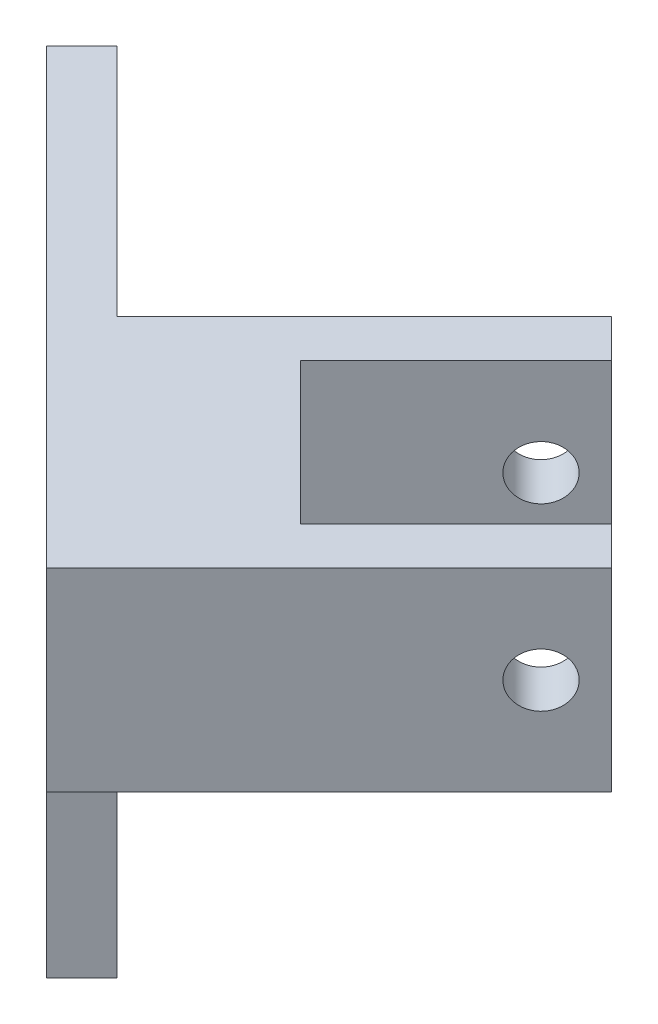
ISO-10303-21;
HEADER;
FILE_DESCRIPTION(('STEP AP214'),'2;1');
FILE_NAME('part.step','',(''),(''),'','','');
FILE_SCHEMA(('AUTOMOTIVE_DESIGN { 1 0 10303 214 1 1 1 1 }'));
ENDSEC;
DATA;
#1=APPLICATION_CONTEXT('core data for automotive mechanical design processes');
#2=APPLICATION_PROTOCOL_DEFINITION('international standard','automotive_design',2000,#1);
#3=PRODUCT_CONTEXT('',#1,'mechanical');
#4=PRODUCT('Part','Part','',(#3));
#5=PRODUCT_RELATED_PRODUCT_CATEGORY('part','',(#4));
#6=PRODUCT_DEFINITION_FORMATION('','',#4);
#7=PRODUCT_DEFINITION_CONTEXT('part definition',#1,'design');
#8=PRODUCT_DEFINITION('design','',#6,#7);
#9=PRODUCT_DEFINITION_SHAPE('','',#8);
#10=(LENGTH_UNIT() NAMED_UNIT(*) SI_UNIT(.MILLI.,.METRE.));
#11=(NAMED_UNIT(*) PLANE_ANGLE_UNIT() SI_UNIT($,.RADIAN.));
#12=(NAMED_UNIT(*) SI_UNIT($,.STERADIAN.) SOLID_ANGLE_UNIT());
#13=UNCERTAINTY_MEASURE_WITH_UNIT(LENGTH_MEASURE(1.E-05),#10,'distance_accuracy_value','');
#14=(GEOMETRIC_REPRESENTATION_CONTEXT(3) GLOBAL_UNCERTAINTY_ASSIGNED_CONTEXT((#13)) GLOBAL_UNIT_ASSIGNED_CONTEXT((#10,
#11,#12)) REPRESENTATION_CONTEXT('',''));
#15=CARTESIAN_POINT('',(0.,0.,0.));
#16=DIRECTION('',(0.,0.,1.));
#17=DIRECTION('',(1.,0.,0.));
#18=AXIS2_PLACEMENT_3D('',#15,#16,#17);
#19=CARTESIAN_POINT('',(33.1841385306785,32.8244024825225,-33.1841385306784));
#20=DIRECTION('',(0.,1.,0.));
#21=DIRECTION('',(0.,0.,1.));
#22=AXIS2_PLACEMENT_3D('',#19,#20,#21);
#23=PLANE('',#22);
#24=DIRECTION('',(0.707106781186547,0.,-0.707106781186548));
#25=VECTOR('',#24,1.);
#26=CARTESIAN_POINT('',(41.8762467926332,32.8244024825225,-24.4920302687237));
#27=LINE('',#26,#25);
#28=CARTESIAN_POINT('',(54.6041688539911,32.8244024825225,-37.2199523300816));
#29=VERTEX_POINT('',#28);
#30=CARTESIAN_POINT('',(70.1605180400951,32.8244024825225,-52.7763015161856));
#31=VERTEX_POINT('',#30);
#32=EDGE_CURVE('E270',#29,#31,#27,.T.);
#33=ORIENTED_EDGE('',*,*,#32,.F.);
#34=DIRECTION('',(-0.707106781186547,0.,-0.707106781186548));
#35=VECTOR('',#34,1.);
#36=CARTESIAN_POINT('',(45.9120605920364,32.8244024825225,-45.9120605920363));
#37=LINE('',#36,#35);
#38=CARTESIAN_POINT('',(68.746304477722,32.8244024825225,-23.0778167063506));
#39=VERTEX_POINT('',#38);
#40=EDGE_CURVE('E272',#39,#29,#37,.T.);
#41=ORIENTED_EDGE('',*,*,#40,.F.);
#42=DIRECTION('',(-0.707106781186548,0.,0.707106781186547));
#43=VECTOR('',#42,1.);
#44=CARTESIAN_POINT('',(56.0183824163642,32.8244024825225,-10.3498946449927));
#45=LINE('',#44,#43);
#46=CARTESIAN_POINT('',(84.3026536638261,32.8244024825225,-38.6341658924546));
#47=VERTEX_POINT('',#46);
#48=EDGE_CURVE('E268',#47,#39,#45,.T.);
#49=ORIENTED_EDGE('',*,*,#48,.F.);
#50=DIRECTION('',(-0.707106781186547,0.,-0.707106781186547));
#51=VECTOR('',#50,1.);
#52=CARTESIAN_POINT('',(88.1320631514751,32.8244024825225,-34.8047564048057));
#53=LINE('',#52,#51);
#54=CARTESIAN_POINT('',(88.1320631514751,32.8244024825225,-34.8047564048057));
#55=VERTEX_POINT('',#54);
#56=EDGE_CURVE('E286',#55,#47,#53,.T.);
#57=ORIENTED_EDGE('',*,*,#56,.F.);
#58=DIRECTION('',(0.707106781186548,0.,-0.707106781186547));
#59=VECTOR('',#58,1.);
#60=CARTESIAN_POINT('',(59.8477919040132,32.8244024825225,-6.52048515734374));
#61=LINE('',#60,#59);
#62=CARTESIAN_POINT('',(59.8477919040132,32.8244024825225,-6.52048515734374));
#63=VERTEX_POINT('',#62);
#64=EDGE_CURVE('E347',#63,#55,#61,.T.);
#65=ORIENTED_EDGE('',*,*,#64,.F.);
#66=DIRECTION('',(0.707106781186547,0.,0.707106781186548));
#67=VECTOR('',#66,1.);
#68=CARTESIAN_POINT('',(33.1841385306785,32.8244024825225,-33.1841385306784));
#69=LINE('',#68,#67);
#70=CARTESIAN_POINT('',(33.1841385306785,32.8244024825225,-33.1841385306784));
#71=VERTEX_POINT('',#70);
#72=EDGE_CURVE('E305',#71,#63,#69,.T.);
#73=ORIENTED_EDGE('',*,*,#72,.F.);
#74=DIRECTION('',(0.707106781186548,0.,-0.707106781186547));
#75=VECTOR('',#74,1.);
#76=CARTESIAN_POINT('',(33.1841385306785,32.8244024825225,-33.1841385306784));
#77=LINE('',#76,#75);
#78=CARTESIAN_POINT('',(36.7196724366112,32.8244024825225,-36.7196724366112));
#79=VERTEX_POINT('',#78);
#80=EDGE_CURVE('E43',#71,#79,#77,.T.);
#81=ORIENTED_EDGE('',*,*,#80,.T.);
#82=DIRECTION('',(0.707106781186547,0.,0.707106781186548));
#83=VECTOR('',#82,1.);
#84=CARTESIAN_POINT('',(36.7196724366112,32.8244024825225,-36.7196724366112));
#85=LINE('',#84,#83);
#86=CARTESIAN_POINT('',(41.5823712109169,32.8244024825225,-31.8569736623054));
#87=VERTEX_POINT('',#86);
#88=EDGE_CURVE('E322',#79,#87,#85,.T.);
#89=ORIENTED_EDGE('',*,*,#88,.T.);
#90=DIRECTION('',(-0.707106781186548,0.,0.707106781186548));
#91=VECTOR('',#90,1.);
#92=CARTESIAN_POINT('',(66.3311085524461,32.8244024825225,-56.6057110038346));
#93=LINE('',#92,#91);
#94=CARTESIAN_POINT('',(66.3311085524461,32.8244024825225,-56.6057110038346));
#95=VERTEX_POINT('',#94);
#96=EDGE_CURVE('E296',#95,#87,#93,.T.);
#97=ORIENTED_EDGE('',*,*,#96,.F.);
#98=EDGE_CURVE('E285',#31,#95,#53,.T.);
#99=ORIENTED_EDGE('',*,*,#98,.F.);
#100=EDGE_LOOP('',(#33,#41,#49,#57,#65,#73,#81,#89,#97,#99));
#101=FACE_BOUND('',#100,.T.);
#102=ADVANCED_FACE('F34',(#101),#23,.F.);
#103=CARTESIAN_POINT('',(14.6118391722927,52.2462761201849,-51.7564378890642));
#104=DIRECTION('',(0.,-1.,0.));
#105=DIRECTION('',(0.,0.,-1.));
#106=AXIS2_PLACEMENT_3D('',#103,#104,#105);
#107=PLANE('',#106);
#108=DIRECTION('',(0.707106781186547,0.,-0.707106781186548));
#109=VECTOR('',#108,1.);
#110=CARTESIAN_POINT('',(54.6041688539911,52.2462761201849,-37.2199523300816));
#111=LINE('',#110,#109);
#112=CARTESIAN_POINT('',(54.6041688539911,52.2462761201849,-37.2199523300816));
#113=VERTEX_POINT('',#112);
#114=CARTESIAN_POINT('',(70.1605180400951,52.2462761201849,-52.7763015161856));
#115=VERTEX_POINT('',#114);
#116=EDGE_CURVE('E252',#113,#115,#111,.T.);
#117=ORIENTED_EDGE('',*,*,#116,.T.);
#118=DIRECTION('',(0.707106781186548,0.,0.707106781186547));
#119=VECTOR('',#118,1.);
#120=CARTESIAN_POINT('',(66.3311085524461,52.246276120185,-56.6057110038346));
#121=LINE('',#120,#119);
#122=CARTESIAN_POINT('',(66.3311085524461,52.246276120185,-56.6057110038346));
#123=VERTEX_POINT('',#122);
#124=EDGE_CURVE('E278',#123,#115,#121,.T.);
#125=ORIENTED_EDGE('',*,*,#124,.F.);
#126=DIRECTION('',(-0.707106781186548,0.,0.707106781186548));
#127=VECTOR('',#126,1.);
#128=CARTESIAN_POINT('',(66.3311085524461,52.246276120185,-56.6057110038346));
#129=LINE('',#128,#127);
#130=CARTESIAN_POINT('',(41.582371210917,52.246276120185,-31.8569736623054));
#131=VERTEX_POINT('',#130);
#132=EDGE_CURVE('E291',#123,#131,#129,.T.);
#133=ORIENTED_EDGE('',*,*,#132,.T.);
#134=DIRECTION('',(-0.707106781186547,0.,-0.707106781186548));
#135=VECTOR('',#134,1.);
#136=CARTESIAN_POINT('',(18.1473730782255,52.2462761201849,-55.2919717949969));
#137=LINE('',#136,#135);
#138=CARTESIAN_POINT('',(18.1473730782255,52.2462761201849,-55.2919717949969));
#139=VERTEX_POINT('',#138);
#140=EDGE_CURVE('E325',#131,#139,#137,.T.);
#141=ORIENTED_EDGE('',*,*,#140,.T.);
#142=DIRECTION('',(0.707106781186548,0.,-0.707106781186547));
#143=VECTOR('',#142,1.);
#144=CARTESIAN_POINT('',(14.6118391722927,52.2462761201849,-51.7564378890642));
#145=LINE('',#144,#143);
#146=CARTESIAN_POINT('',(14.6118391722927,52.2462761201849,-51.7564378890642));
#147=VERTEX_POINT('',#146);
#148=EDGE_CURVE('E341',#147,#139,#145,.T.);
#149=ORIENTED_EDGE('',*,*,#148,.F.);
#150=DIRECTION('',(-0.707106781186547,0.,-0.707106781186548));
#151=VECTOR('',#150,1.);
#152=CARTESIAN_POINT('',(14.6118391722927,52.2462761201849,-51.7564378890642));
#153=LINE('',#152,#151);
#154=CARTESIAN_POINT('',(59.8477919040132,52.2462761201849,-6.52048515734374));
#155=VERTEX_POINT('',#154);
#156=EDGE_CURVE('E309',#155,#147,#153,.T.);
#157=ORIENTED_EDGE('',*,*,#156,.F.);
#158=DIRECTION('',(0.707106781186548,0.,-0.707106781186547));
#159=VECTOR('',#158,1.);
#160=CARTESIAN_POINT('',(59.8477919040132,52.2462761201849,-6.52048515734374));
#161=LINE('',#160,#159);
#162=CARTESIAN_POINT('',(88.1320631514751,52.2462761201849,-34.8047564048057));
#163=VERTEX_POINT('',#162);
#164=EDGE_CURVE('E344',#155,#163,#161,.T.);
#165=ORIENTED_EDGE('',*,*,#164,.T.);
#166=CARTESIAN_POINT('',(84.302653663826,52.2462761201849,-38.6341658924547));
#167=VERTEX_POINT('',#166);
#168=EDGE_CURVE('E282',#167,#163,#121,.T.);
#169=ORIENTED_EDGE('',*,*,#168,.F.);
#170=DIRECTION('',(-0.707106781186548,0.,0.707106781186547));
#171=VECTOR('',#170,1.);
#172=CARTESIAN_POINT('',(84.3026536638261,52.246276120185,-38.6341658924546));
#173=LINE('',#172,#171);
#174=CARTESIAN_POINT('',(68.746304477722,52.246276120185,-23.0778167063506));
#175=VERTEX_POINT('',#174);
#176=EDGE_CURVE('E255',#167,#175,#173,.T.);
#177=ORIENTED_EDGE('',*,*,#176,.T.);
#178=DIRECTION('',(-0.707106781186547,0.,-0.707106781186548));
#179=VECTOR('',#178,1.);
#180=CARTESIAN_POINT('',(68.746304477722,52.246276120185,-23.0778167063506));
#181=LINE('',#180,#179);
#182=EDGE_CURVE('E249',#175,#113,#181,.T.);
#183=ORIENTED_EDGE('',*,*,#182,.T.);
#184=EDGE_LOOP('',(#117,#125,#133,#141,#149,#157,#165,#169,#177,#183));
#185=FACE_BOUND('',#184,.T.);
#186=ADVANCED_FACE('F375',(#185),#107,.F.);
#187=CARTESIAN_POINT('',(61.4684097781404,0.,-61.4684097781404));
#188=DIRECTION('',(0.707106781186547,0.,-0.707106781186548));
#189=DIRECTION('',(-0.707106781186548,0.,-0.707106781186547));
#190=AXIS2_PLACEMENT_3D('',#187,#188,#189);
#191=PLANE('',#190);
#192=ORIENTED_EDGE('',*,*,#124,.T.);
#193=DIRECTION('',(0.,1.,0.));
#194=VECTOR('',#193,1.);
#195=CARTESIAN_POINT('',(70.1605180400951,27.2462761201849,-52.7763015161856));
#196=LINE('',#195,#194);
#197=EDGE_CURVE('E263',#31,#115,#196,.T.);
#198=ORIENTED_EDGE('',*,*,#197,.F.);
#199=ORIENTED_EDGE('',*,*,#98,.T.);
#200=DIRECTION('',(0.,1.,0.));
#201=VECTOR('',#200,1.);
#202=CARTESIAN_POINT('',(66.3311085524461,32.8244024825225,-56.6057110038346));
#203=LINE('',#202,#201);
#204=EDGE_CURVE('E289',#95,#123,#203,.T.);
#205=ORIENTED_EDGE('',*,*,#204,.T.);
#206=EDGE_LOOP('',(#192,#198,#199,#205));
#207=FACE_BOUND('',#206,.T.);
#208=ADVANCED_FACE('F381',(#207),#191,.T.);
#209=ORIENTED_EDGE('',*,*,#56,.T.);
#210=DIRECTION('',(0.,1.,0.));
#211=VECTOR('',#210,1.);
#212=CARTESIAN_POINT('',(84.3026536638261,27.246276120185,-38.6341658924546));
#213=LINE('',#212,#211);
#214=EDGE_CURVE('E260',#47,#167,#213,.T.);
#215=ORIENTED_EDGE('',*,*,#214,.T.);
#216=ORIENTED_EDGE('',*,*,#168,.T.);
#217=DIRECTION('',(0.,-1.,0.));
#218=VECTOR('',#217,1.);
#219=CARTESIAN_POINT('',(88.1320631514751,52.2462761201849,-34.8047564048057));
#220=LINE('',#219,#218);
#221=EDGE_CURVE('E281',#163,#55,#220,.T.);
#222=ORIENTED_EDGE('',*,*,#221,.T.);
#223=EDGE_LOOP('',(#209,#215,#216,#222));
#224=FACE_BOUND('',#223,.T.);
#225=ADVANCED_FACE('F370',(#224),#191,.T.);
#226=CARTESIAN_POINT('',(52.7767240921477,42.5353393013537,-63.0890276522675));
#227=DIRECTION('',(0.707106781186547,0.,0.707106781186547));
#228=DIRECTION('',(0.707106781186548,0.,-0.707106781186548));
#229=AXIS2_PLACEMENT_3D('',#226,#227,#228);
#230=CYLINDRICAL_SURFACE('',#229,2.7);
#231=CARTESIAN_POINT('',(62.7955746465134,42.5353393013537,-53.0701770979018));
#232=DIRECTION('',(0.707106781186548,0.,0.707106781186548));
#233=DIRECTION('',(0.707106781186548,0.,-0.707106781186548));
#234=AXIS2_PLACEMENT_3D('',#231,#232,#233);
#235=CIRCLE('',#234,2.7);
#236=CARTESIAN_POINT('',(64.704762955717,42.5353393013537,-54.9793654071055));
#237=VERTEX_POINT('',#236);
#238=EDGE_CURVE('E277',#237,#237,#235,.T.);
#239=ORIENTED_EDGE('',*,*,#238,.F.);
#240=EDGE_LOOP('',(#239));
#241=FACE_BOUND('',#240,.T.);
#242=CARTESIAN_POINT('',(66.6249841341624,42.5353393013537,-49.2407676102529));
#243=DIRECTION('',(0.707106781186548,0.,0.707106781186547));
#244=DIRECTION('',(0.707106781186547,0.,-0.707106781186548));
#245=AXIS2_PLACEMENT_3D('',#242,#243,#244);
#246=CIRCLE('',#245,2.7);
#247=CARTESIAN_POINT('',(68.534172443366,42.5353393013537,-51.1499559194565));
#248=VERTEX_POINT('',#247);
#249=EDGE_CURVE('E38',#248,#248,#246,.F.);
#250=ORIENTED_EDGE('',*,*,#249,.F.);
#251=EDGE_LOOP('',(#250));
#252=FACE_BOUND('',#251,.T.);
#253=ADVANCED_FACE('F361',(#241,#252),#230,.F.);
#254=CARTESIAN_POINT('',(84.5965292455423,42.5353393013537,-31.2692224988729));
#255=DIRECTION('',(0.707106781186548,0.,0.707106781186548));
#256=DIRECTION('',(0.707106781186548,0.,-0.707106781186548));
#257=AXIS2_PLACEMENT_3D('',#254,#255,#256);
#258=CIRCLE('',#257,2.7);
#259=CARTESIAN_POINT('',(86.505717554746,42.5353393013537,-33.1784108080766));
#260=VERTEX_POINT('',#259);
#261=EDGE_CURVE('E274',#260,#260,#258,.T.);
#262=ORIENTED_EDGE('',*,*,#261,.T.);
#263=EDGE_LOOP('',(#262));
#264=FACE_BOUND('',#263,.T.);
#265=CARTESIAN_POINT('',(80.7671197578933,42.5353393013537,-35.0986319865219));
#266=DIRECTION('',(-0.707106781186547,0.,-0.707106781186548));
#267=DIRECTION('',(-0.707106781186548,0.,0.707106781186547));
#268=AXIS2_PLACEMENT_3D('',#265,#266,#267);
#269=CIRCLE('',#268,2.7);
#270=CARTESIAN_POINT('',(78.8579314486896,42.5353393013537,-33.1894436773182));
#271=VERTEX_POINT('',#270);
#272=EDGE_CURVE('E267',#271,#271,#269,.F.);
#273=ORIENTED_EDGE('',*,*,#272,.F.);
#274=EDGE_LOOP('',(#273));
#275=FACE_BOUND('',#274,.T.);
#276=ADVANCED_FACE('F358',(#264,#275),#230,.F.);
#277=CARTESIAN_POINT('',(36.7196724366112,0.,-36.7196724366112));
#278=DIRECTION('',(0.707106781186548,0.,-0.707106781186547));
#279=DIRECTION('',(-0.707106781186547,0.,-0.707106781186548));
#280=AXIS2_PLACEMENT_3D('',#277,#278,#279);
#281=PLANE('',#280);
#282=CARTESIAN_POINT('',(25.9338579225889,-11.8888107983741,-47.5054869506334));
#283=DIRECTION('',(0.707106781186548,0.,-0.707106781186547));
#284=DIRECTION('',(-0.707106781186547,0.,-0.707106781186548));
#285=AXIS2_PLACEMENT_3D('',#282,#283,#284);
#286=CIRCLE('',#285,1.85);
#287=CARTESIAN_POINT('',(27.2420054677841,-11.8888107983741,-46.1973394054383));
#288=VERTEX_POINT('',#287);
#289=CARTESIAN_POINT('',(24.6257103773938,-11.8888107983741,-48.8136344958286));
#290=VERTEX_POINT('',#289);
#291=EDGE_CURVE('E192',#288,#290,#286,.T.);
#292=ORIENTED_EDGE('',*,*,#291,.F.);
#293=DIRECTION('',(0.,-1.,0.));
#294=VECTOR('',#293,1.);
#295=CARTESIAN_POINT('',(27.2420054677841,0.,-46.1973394054383));
#296=LINE('',#295,#294);
#297=CARTESIAN_POINT('',(27.2420054677841,19.9311892016259,-46.1973394054383));
#298=VERTEX_POINT('',#297);
#299=EDGE_CURVE('E242',#298,#288,#296,.T.);
#300=ORIENTED_EDGE('',*,*,#299,.F.);
#301=CARTESIAN_POINT('',(25.9338579225889,19.9311892016259,-47.5054869506334));
#302=DIRECTION('',(0.707106781186548,0.,-0.707106781186547));
#303=DIRECTION('',(-0.707106781186547,0.,-0.707106781186548));
#304=AXIS2_PLACEMENT_3D('',#301,#302,#303);
#305=CIRCLE('',#304,1.85);
#306=CARTESIAN_POINT('',(24.6257103773938,19.9311892016259,-48.8136344958286));
#307=VERTEX_POINT('',#306);
#308=EDGE_CURVE('E244',#307,#298,#305,.T.);
#309=ORIENTED_EDGE('',*,*,#308,.F.);
#310=DIRECTION('',(0.,-1.,0.));
#311=VECTOR('',#310,1.);
#312=CARTESIAN_POINT('',(24.6257103773938,0.,-48.8136344958286));
#313=LINE('',#312,#311);
#314=EDGE_CURVE('E246',#307,#290,#313,.T.);
#315=ORIENTED_EDGE('',*,*,#314,.T.);
#316=EDGE_LOOP('',(#292,#300,#309,#315));
#317=FACE_BOUND('',#316,.T.);
#318=DIRECTION('',(0.,-1.,0.));
#319=VECTOR('',#318,1.);
#320=CARTESIAN_POINT('',(13.524133912765,0.,-59.9152109604573));
#321=LINE('',#320,#319);
#322=CARTESIAN_POINT('',(13.5241339127651,19.9311892016259,-59.9152109604573));
#323=VERTEX_POINT('',#322);
#324=CARTESIAN_POINT('',(13.5241339127651,-11.8888107983741,-59.9152109604573));
#325=VERTEX_POINT('',#324);
#326=EDGE_CURVE('E240',#323,#325,#321,.T.);
#327=ORIENTED_EDGE('',*,*,#326,.F.);
#328=CARTESIAN_POINT('',(12.2159863675699,19.9311892016259,-61.2233585056525));
#329=DIRECTION('',(0.707106781186548,0.,-0.707106781186547));
#330=DIRECTION('',(-0.707106781186547,0.,-0.707106781186548));
#331=AXIS2_PLACEMENT_3D('',#328,#329,#330);
#332=CIRCLE('',#331,1.85);
#333=CARTESIAN_POINT('',(10.9078388223748,19.9311892016259,-62.5315060508475));
#334=VERTEX_POINT('',#333);
#335=EDGE_CURVE('E228',#334,#323,#332,.T.);
#336=ORIENTED_EDGE('',*,*,#335,.F.);
#337=DIRECTION('',(0.,-1.,0.));
#338=VECTOR('',#337,1.);
#339=CARTESIAN_POINT('',(10.9078388223748,0.,-62.5315060508476));
#340=LINE('',#339,#338);
#341=CARTESIAN_POINT('',(10.9078388223748,-11.8888107983741,-62.5315060508476));
#342=VERTEX_POINT('',#341);
#343=EDGE_CURVE('E235',#334,#342,#340,.T.);
#344=ORIENTED_EDGE('',*,*,#343,.T.);
#345=CARTESIAN_POINT('',(12.2159863675699,-11.8888107983741,-61.2233585056525));
#346=DIRECTION('',(0.707106781186548,0.,-0.707106781186547));
#347=DIRECTION('',(-0.707106781186547,0.,-0.707106781186548));
#348=AXIS2_PLACEMENT_3D('',#345,#346,#347);
#349=CIRCLE('',#348,1.85);
#350=EDGE_CURVE('E238',#325,#342,#349,.T.);
#351=ORIENTED_EDGE('',*,*,#350,.F.);
#352=EDGE_LOOP('',(#327,#336,#344,#351));
#353=FACE_BOUND('',#352,.T.);
#354=ORIENTED_EDGE('',*,*,#140,.F.);
#355=DIRECTION('',(0.,1.,0.));
#356=VECTOR('',#355,1.);
#357=CARTESIAN_POINT('',(41.582371210917,32.8244024825225,-31.8569736623054));
#358=LINE('',#357,#356);
#359=EDGE_CURVE('E292',#87,#131,#358,.T.);
#360=ORIENTED_EDGE('',*,*,#359,.F.);
#361=ORIENTED_EDGE('',*,*,#88,.F.);
#362=DIRECTION('',(0.500000000000001,0.707106781186546,0.500000000000001));
#363=VECTOR('',#362,1.);
#364=CARTESIAN_POINT('',(30.1332776936908,23.5098337099417,-43.3060671795316));
#365=LINE('',#364,#363);
#366=CARTESIAN_POINT('',(30.1332776936908,23.5098337099417,-43.3060671795316));
#367=VERTEX_POINT('',#366);
#368=EDGE_CURVE('E320',#367,#79,#365,.T.);
#369=ORIENTED_EDGE('',*,*,#368,.F.);
#370=DIRECTION('',(0.,1.,0.));
#371=VECTOR('',#370,1.);
#372=CARTESIAN_POINT('',(30.1332776936908,-16.523019044903,-43.3060671795316));
#373=LINE('',#372,#371);
#374=CARTESIAN_POINT('',(30.1332776936908,-16.523019044903,-43.3060671795316));
#375=VERTEX_POINT('',#374);
#376=EDGE_CURVE('E298',#375,#367,#373,.T.);
#377=ORIENTED_EDGE('',*,*,#376,.F.);
#378=DIRECTION('',(0.707106781186548,0.,0.707106781186548));
#379=VECTOR('',#378,1.);
#380=CARTESIAN_POINT('',(8.01656659646805,-16.523019044903,-65.4227782767543));
#381=LINE('',#380,#379);
#382=CARTESIAN_POINT('',(8.01656659646805,-16.523019044903,-65.4227782767543));
#383=VERTEX_POINT('',#382);
#384=EDGE_CURVE('E303',#383,#375,#381,.T.);
#385=ORIENTED_EDGE('',*,*,#384,.F.);
#386=DIRECTION('',(0.,-1.,0.));
#387=VECTOR('',#386,1.);
#388=CARTESIAN_POINT('',(8.01656659646804,32.8244024825225,-65.4227782767543));
#389=LINE('',#388,#387);
#390=CARTESIAN_POINT('',(8.01656659646804,37.9191521959063,-65.4227782767543));
#391=VERTEX_POINT('',#390);
#392=EDGE_CURVE('E330',#391,#383,#389,.T.);
#393=ORIENTED_EDGE('',*,*,#392,.F.);
#394=DIRECTION('',(-0.500000000000001,-0.707106781186546,-0.500000000000001));
#395=VECTOR('',#394,1.);
#396=CARTESIAN_POINT('',(8.01656659646804,37.9191521959063,-65.4227782767543));
#397=LINE('',#396,#395);
#398=EDGE_CURVE('E327',#139,#391,#397,.T.);
#399=ORIENTED_EDGE('',*,*,#398,.F.);
#400=EDGE_LOOP('',(#354,#360,#361,#369,#377,#385,#393,#399));
#401=FACE_BOUND('',#400,.T.);
#402=ADVANCED_FACE('F360',(#317,#353,#401),#281,.T.);
#403=CARTESIAN_POINT('',(26.5977437877581,-16.523019044903,-39.7705332735988));
#404=DIRECTION('',(-0.707106781186547,0.,-0.707106781186548));
#405=DIRECTION('',(-0.707106781186548,0.,0.707106781186547));
#406=AXIS2_PLACEMENT_3D('',#403,#404,#405);
#407=PLANE('',#406);
#408=ORIENTED_EDGE('',*,*,#376,.T.);
#409=DIRECTION('',(0.707106781186548,0.,-0.707106781186547));
#410=VECTOR('',#409,1.);
#411=CARTESIAN_POINT('',(26.5977437877581,23.5098337099417,-39.7705332735988));
#412=LINE('',#411,#410);
#413=CARTESIAN_POINT('',(26.5977437877581,23.5098337099417,-39.7705332735988));
#414=VERTEX_POINT('',#413);
#415=EDGE_CURVE('E11',#414,#367,#412,.T.);
#416=ORIENTED_EDGE('',*,*,#415,.F.);
#417=DIRECTION('',(0.,1.,0.));
#418=VECTOR('',#417,1.);
#419=CARTESIAN_POINT('',(26.5977437877581,-16.523019044903,-39.7705332735988));
#420=LINE('',#419,#418);
#421=CARTESIAN_POINT('',(26.5977437877581,-16.523019044903,-39.7705332735988));
#422=VERTEX_POINT('',#421);
#423=EDGE_CURVE('E299',#422,#414,#420,.T.);
#424=ORIENTED_EDGE('',*,*,#423,.F.);
#425=DIRECTION('',(0.707106781186548,0.,-0.707106781186547));
#426=VECTOR('',#425,1.);
#427=CARTESIAN_POINT('',(26.5977437877581,-16.523019044903,-39.7705332735988));
#428=LINE('',#427,#426);
#429=EDGE_CURVE('E317',#422,#375,#428,.T.);
#430=ORIENTED_EDGE('',*,*,#429,.T.);
#431=EDGE_LOOP('',(#408,#416,#424,#430));
#432=FACE_BOUND('',#431,.T.);
#433=ADVANCED_FACE('F36',(#432),#407,.F.);
#434=CARTESIAN_POINT('',(26.5977437877581,23.5098337099417,-39.7705332735988));
#435=DIRECTION('',(-0.499999999999999,0.707106781186549,-0.499999999999999));
#436=DIRECTION('',(0.,0.577350269189624,0.816496580927727));
#437=AXIS2_PLACEMENT_3D('',#434,#435,#436);
#438=PLANE('',#437);
#439=ORIENTED_EDGE('',*,*,#368,.T.);
#440=ORIENTED_EDGE('',*,*,#80,.F.);
#441=DIRECTION('',(0.500000000000001,0.707106781186546,0.500000000000001));
#442=VECTOR('',#441,1.);
#443=CARTESIAN_POINT('',(26.5977437877581,23.5098337099417,-39.7705332735988));
#444=LINE('',#443,#442);
#445=EDGE_CURVE('E302',#414,#71,#444,.T.);
#446=ORIENTED_EDGE('',*,*,#445,.F.);
#447=ORIENTED_EDGE('',*,*,#415,.T.);
#448=EDGE_LOOP('',(#439,#440,#446,#447));
#449=FACE_BOUND('',#448,.T.);
#450=ADVANCED_FACE('F387',(#449),#438,.F.);
#451=CARTESIAN_POINT('',(59.8477919040132,52.2462761201849,-6.52048515734374));
#452=DIRECTION('',(-0.707106781186547,0.,-0.707106781186548));
#453=DIRECTION('',(-0.707106781186548,0.,0.707106781186547));
#454=AXIS2_PLACEMENT_3D('',#451,#452,#453);
#455=PLANE('',#454);
#456=ORIENTED_EDGE('',*,*,#261,.F.);
#457=EDGE_LOOP('',(#456));
#458=FACE_BOUND('',#457,.T.);
#459=ORIENTED_EDGE('',*,*,#64,.T.);
#460=ORIENTED_EDGE('',*,*,#221,.F.);
#461=ORIENTED_EDGE('',*,*,#164,.F.);
#462=DIRECTION('',(0.,1.,0.));
#463=VECTOR('',#462,1.);
#464=CARTESIAN_POINT('',(59.8477919040132,52.2462761201849,-6.52048515734374));
#465=LINE('',#464,#463);
#466=EDGE_CURVE('E307',#63,#155,#465,.T.);
#467=ORIENTED_EDGE('',*,*,#466,.F.);
#468=EDGE_LOOP('',(#459,#460,#461,#467));
#469=FACE_BOUND('',#468,.T.);
#470=ADVANCED_FACE('F386',(#458,#469),#455,.F.);
#471=CARTESIAN_POINT('',(4.48103269053531,37.9191521959063,-61.8872443708216));
#472=DIRECTION('',(0.499999999999999,-0.707106781186549,0.499999999999999));
#473=DIRECTION('',(0.,-0.577350269189625,-0.816496580927727));
#474=AXIS2_PLACEMENT_3D('',#471,#472,#473);
#475=PLANE('',#474);
#476=ORIENTED_EDGE('',*,*,#398,.T.);
#477=DIRECTION('',(0.707106781186548,0.,-0.707106781186547));
#478=VECTOR('',#477,1.);
#479=CARTESIAN_POINT('',(4.48103269053531,37.9191521959063,-61.8872443708216));
#480=LINE('',#479,#478);
#481=CARTESIAN_POINT('',(4.48103269053531,37.9191521959063,-61.8872443708216));
#482=VERTEX_POINT('',#481);
#483=EDGE_CURVE('E338',#482,#391,#480,.T.);
#484=ORIENTED_EDGE('',*,*,#483,.F.);
#485=DIRECTION('',(-0.500000000000001,-0.707106781186546,-0.500000000000001));
#486=VECTOR('',#485,1.);
#487=CARTESIAN_POINT('',(4.48103269053531,37.9191521959063,-61.8872443708216));
#488=LINE('',#487,#486);
#489=EDGE_CURVE('E311',#147,#482,#488,.T.);
#490=ORIENTED_EDGE('',*,*,#489,.F.);
#491=ORIENTED_EDGE('',*,*,#148,.T.);
#492=EDGE_LOOP('',(#476,#484,#490,#491));
#493=FACE_BOUND('',#492,.T.);
#494=ADVANCED_FACE('F394',(#493),#475,.F.);
#495=CARTESIAN_POINT('',(4.48103269053531,32.8244024825225,-61.8872443708216));
#496=DIRECTION('',(0.707106781186547,0.,0.707106781186548));
#497=DIRECTION('',(0.707106781186548,0.,-0.707106781186547));
#498=AXIS2_PLACEMENT_3D('',#495,#496,#497);
#499=PLANE('',#498);
#500=ORIENTED_EDGE('',*,*,#392,.T.);
#501=DIRECTION('',(0.707106781186548,0.,-0.707106781186547));
#502=VECTOR('',#501,1.);
#503=CARTESIAN_POINT('',(4.48103269053531,-16.523019044903,-61.8872443708216));
#504=LINE('',#503,#502);
#505=CARTESIAN_POINT('',(4.48103269053531,-16.523019044903,-61.8872443708216));
#506=VERTEX_POINT('',#505);
#507=EDGE_CURVE('E335',#506,#383,#504,.T.);
#508=ORIENTED_EDGE('',*,*,#507,.F.);
#509=DIRECTION('',(0.,-1.,0.));
#510=VECTOR('',#509,1.);
#511=CARTESIAN_POINT('',(4.48103269053531,32.8244024825225,-61.8872443708216));
#512=LINE('',#511,#510);
#513=EDGE_CURVE('E313',#482,#506,#512,.T.);
#514=ORIENTED_EDGE('',*,*,#513,.F.);
#515=ORIENTED_EDGE('',*,*,#483,.T.);
#516=EDGE_LOOP('',(#500,#508,#514,#515));
#517=FACE_BOUND('',#516,.T.);
#518=ADVANCED_FACE('F445',(#517),#499,.F.);
#519=CARTESIAN_POINT('',(4.48103269053531,-16.523019044903,-61.8872443708216));
#520=DIRECTION('',(0.,1.,0.));
#521=DIRECTION('',(0.,0.,1.));
#522=AXIS2_PLACEMENT_3D('',#519,#520,#521);
#523=PLANE('',#522);
#524=ORIENTED_EDGE('',*,*,#384,.T.);
#525=ORIENTED_EDGE('',*,*,#429,.F.);
#526=DIRECTION('',(0.707106781186548,0.,0.707106781186548));
#527=VECTOR('',#526,1.);
#528=CARTESIAN_POINT('',(4.48103269053531,-16.523019044903,-61.8872443708216));
#529=LINE('',#528,#527);
#530=EDGE_CURVE('E315',#506,#422,#529,.T.);
#531=ORIENTED_EDGE('',*,*,#530,.F.);
#532=ORIENTED_EDGE('',*,*,#507,.T.);
#533=EDGE_LOOP('',(#524,#525,#531,#532));
#534=FACE_BOUND('',#533,.T.);
#535=ADVANCED_FACE('F441',(#534),#523,.F.);
#536=CARTESIAN_POINT('',(33.1841385306785,0.,-33.1841385306784));
#537=DIRECTION('',(0.707106781186548,0.,-0.707106781186547));
#538=DIRECTION('',(-0.707106781186547,0.,-0.707106781186548));
#539=AXIS2_PLACEMENT_3D('',#536,#537,#538);
#540=PLANE('',#539);
#541=DIRECTION('',(0.,1.,0.));
#542=VECTOR('',#541,1.);
#543=CARTESIAN_POINT('',(23.7064715618513,-11.8888107983741,-42.6618054995056));
#544=LINE('',#543,#542);
#545=CARTESIAN_POINT('',(23.7064715618513,-11.8888107983741,-42.6618054995056));
#546=VERTEX_POINT('',#545);
#547=CARTESIAN_POINT('',(23.7064715618513,19.9311892016259,-42.6618054995056));
#548=VERTEX_POINT('',#547);
#549=EDGE_CURVE('E210',#546,#548,#544,.T.);
#550=ORIENTED_EDGE('',*,*,#549,.F.);
#551=CARTESIAN_POINT('',(22.3983240166562,-11.8888107983741,-43.9699530447007));
#552=DIRECTION('',(-0.707106781186548,0.,0.707106781186547));
#553=DIRECTION('',(0.707106781186547,0.,0.707106781186548));
#554=AXIS2_PLACEMENT_3D('',#551,#552,#553);
#555=CIRCLE('',#554,1.85);
#556=CARTESIAN_POINT('',(21.0901764714611,-11.8888107983741,-45.2781005898958));
#557=VERTEX_POINT('',#556);
#558=EDGE_CURVE('E189',#557,#546,#555,.T.);
#559=ORIENTED_EDGE('',*,*,#558,.F.);
#560=DIRECTION('',(0.,1.,0.));
#561=VECTOR('',#560,1.);
#562=CARTESIAN_POINT('',(21.0901764714611,-11.8888107983741,-45.2781005898958));
#563=LINE('',#562,#561);
#564=CARTESIAN_POINT('',(21.0901764714611,19.9311892016259,-45.2781005898958));
#565=VERTEX_POINT('',#564);
#566=EDGE_CURVE('E198',#557,#565,#563,.T.);
#567=ORIENTED_EDGE('',*,*,#566,.T.);
#568=CARTESIAN_POINT('',(22.3983240166562,19.9311892016259,-43.9699530447007));
#569=DIRECTION('',(-0.707106781186548,0.,0.707106781186547));
#570=DIRECTION('',(0.707106781186547,0.,0.707106781186548));
#571=AXIS2_PLACEMENT_3D('',#568,#569,#570);
#572=CIRCLE('',#571,1.85);
#573=EDGE_CURVE('E204',#548,#565,#572,.T.);
#574=ORIENTED_EDGE('',*,*,#573,.F.);
#575=EDGE_LOOP('',(#550,#559,#567,#574));
#576=FACE_BOUND('',#575,.T.);
#577=CARTESIAN_POINT('',(8.68045246163718,19.9311892016259,-57.6878245997197));
#578=DIRECTION('',(-0.707106781186548,0.,0.707106781186547));
#579=DIRECTION('',(0.707106781186547,0.,0.707106781186548));
#580=AXIS2_PLACEMENT_3D('',#577,#578,#579);
#581=CIRCLE('',#580,1.85);
#582=CARTESIAN_POINT('',(9.98860000683229,19.9311892016259,-56.3796770545246));
#583=VERTEX_POINT('',#582);
#584=CARTESIAN_POINT('',(7.37230491644209,19.9311892016259,-58.9959721449148));
#585=VERTEX_POINT('',#584);
#586=EDGE_CURVE('E213',#583,#585,#581,.T.);
#587=ORIENTED_EDGE('',*,*,#586,.F.);
#588=DIRECTION('',(0.,1.,0.));
#589=VECTOR('',#588,1.);
#590=CARTESIAN_POINT('',(9.98860000683231,0.,-56.3796770545246));
#591=LINE('',#590,#589);
#592=CARTESIAN_POINT('',(9.98860000683231,-11.8888107983741,-56.3796770545246));
#593=VERTEX_POINT('',#592);
#594=EDGE_CURVE('E211',#593,#583,#591,.T.);
#595=ORIENTED_EDGE('',*,*,#594,.F.);
#596=CARTESIAN_POINT('',(8.68045246163718,-11.8888107983741,-57.6878245997197));
#597=DIRECTION('',(-0.707106781186548,0.,0.707106781186547));
#598=DIRECTION('',(0.707106781186547,0.,0.707106781186548));
#599=AXIS2_PLACEMENT_3D('',#596,#597,#598);
#600=CIRCLE('',#599,1.85);
#601=CARTESIAN_POINT('',(7.37230491644208,-11.8888107983741,-58.9959721449148));
#602=VERTEX_POINT('',#601);
#603=EDGE_CURVE('E222',#602,#593,#600,.T.);
#604=ORIENTED_EDGE('',*,*,#603,.F.);
#605=DIRECTION('',(0.,1.,0.));
#606=VECTOR('',#605,1.);
#607=CARTESIAN_POINT('',(7.37230491644208,0.,-58.9959721449148));
#608=LINE('',#607,#606);
#609=EDGE_CURVE('E219',#602,#585,#608,.T.);
#610=ORIENTED_EDGE('',*,*,#609,.T.);
#611=EDGE_LOOP('',(#587,#595,#604,#610));
#612=FACE_BOUND('',#611,.T.);
#613=ORIENTED_EDGE('',*,*,#423,.T.);
#614=ORIENTED_EDGE('',*,*,#445,.T.);
#615=ORIENTED_EDGE('',*,*,#72,.T.);
#616=ORIENTED_EDGE('',*,*,#466,.T.);
#617=ORIENTED_EDGE('',*,*,#156,.T.);
#618=ORIENTED_EDGE('',*,*,#489,.T.);
#619=ORIENTED_EDGE('',*,*,#513,.T.);
#620=ORIENTED_EDGE('',*,*,#530,.T.);
#621=EDGE_LOOP('',(#613,#614,#615,#616,#617,#618,#619,#620));
#622=FACE_BOUND('',#621,.T.);
#623=ADVANCED_FACE('F208',(#576,#612,#622),#540,.F.);
#624=CARTESIAN_POINT('',(66.3311085524461,32.8244024825225,-56.6057110038346));
#625=DIRECTION('',(0.707106781186548,0.,0.707106781186548));
#626=DIRECTION('',(0.707106781186548,0.,-0.707106781186548));
#627=AXIS2_PLACEMENT_3D('',#624,#625,#626);
#628=PLANE('',#627);
#629=ORIENTED_EDGE('',*,*,#238,.T.);
#630=EDGE_LOOP('',(#629));
#631=FACE_BOUND('',#630,.T.);
#632=ORIENTED_EDGE('',*,*,#359,.T.);
#633=ORIENTED_EDGE('',*,*,#132,.F.);
#634=ORIENTED_EDGE('',*,*,#204,.F.);
#635=ORIENTED_EDGE('',*,*,#96,.T.);
#636=EDGE_LOOP('',(#632,#633,#634,#635));
#637=FACE_BOUND('',#636,.T.);
#638=ADVANCED_FACE('F410',(#631,#637),#628,.F.);
#639=CARTESIAN_POINT('',(68.746304477722,27.246276120185,-23.0778167063506));
#640=DIRECTION('',(0.707106781186548,0.,-0.707106781186547));
#641=DIRECTION('',(-0.707106781186547,0.,-0.707106781186548));
#642=AXIS2_PLACEMENT_3D('',#639,#640,#641);
#643=PLANE('',#642);
#644=ORIENTED_EDGE('',*,*,#40,.T.);
#645=DIRECTION('',(0.,1.,0.));
#646=VECTOR('',#645,1.);
#647=CARTESIAN_POINT('',(54.6041688539911,27.2462761201849,-37.2199523300816));
#648=LINE('',#647,#646);
#649=EDGE_CURVE('E265',#29,#113,#648,.T.);
#650=ORIENTED_EDGE('',*,*,#649,.T.);
#651=ORIENTED_EDGE('',*,*,#182,.F.);
#652=DIRECTION('',(0.,1.,0.));
#653=VECTOR('',#652,1.);
#654=CARTESIAN_POINT('',(68.746304477722,27.246276120185,-23.0778167063506));
#655=LINE('',#654,#653);
#656=EDGE_CURVE('E258',#39,#175,#655,.T.);
#657=ORIENTED_EDGE('',*,*,#656,.F.);
#658=EDGE_LOOP('',(#644,#650,#651,#657));
#659=FACE_BOUND('',#658,.T.);
#660=ADVANCED_FACE('F425',(#659),#643,.T.);
#661=CARTESIAN_POINT('',(54.6041688539911,27.2462761201849,-37.2199523300816));
#662=DIRECTION('',(0.707106781186548,0.,0.707106781186547));
#663=DIRECTION('',(0.707106781186547,0.,-0.707106781186548));
#664=AXIS2_PLACEMENT_3D('',#661,#662,#663);
#665=PLANE('',#664);
#666=ORIENTED_EDGE('',*,*,#249,.T.);
#667=EDGE_LOOP('',(#666));
#668=FACE_BOUND('',#667,.T.);
#669=ORIENTED_EDGE('',*,*,#32,.T.);
#670=ORIENTED_EDGE('',*,*,#197,.T.);
#671=ORIENTED_EDGE('',*,*,#116,.F.);
#672=ORIENTED_EDGE('',*,*,#649,.F.);
#673=EDGE_LOOP('',(#669,#670,#671,#672));
#674=FACE_BOUND('',#673,.T.);
#675=ADVANCED_FACE('F422',(#668,#674),#665,.T.);
#676=CARTESIAN_POINT('',(84.3026536638261,27.246276120185,-38.6341658924546));
#677=DIRECTION('',(-0.707106781186547,0.,-0.707106781186548));
#678=DIRECTION('',(-0.707106781186548,0.,0.707106781186547));
#679=AXIS2_PLACEMENT_3D('',#676,#677,#678);
#680=PLANE('',#679);
#681=ORIENTED_EDGE('',*,*,#272,.T.);
#682=EDGE_LOOP('',(#681));
#683=FACE_BOUND('',#682,.T.);
#684=ORIENTED_EDGE('',*,*,#48,.T.);
#685=ORIENTED_EDGE('',*,*,#656,.T.);
#686=ORIENTED_EDGE('',*,*,#176,.F.);
#687=ORIENTED_EDGE('',*,*,#214,.F.);
#688=EDGE_LOOP('',(#684,#685,#686,#687));
#689=FACE_BOUND('',#688,.T.);
#690=ADVANCED_FACE('F355',(#683,#689),#680,.T.);
#691=CARTESIAN_POINT('',(41.8084051602269,0.,-88.1994822079192));
#692=DIRECTION('',(0.707106781186547,0.,0.707106781186547));
#693=DIRECTION('',(0.707106781186548,0.,-0.707106781186547));
#694=AXIS2_PLACEMENT_3D('',#691,#692,#693);
#695=PLANE('',#694);
#696=ORIENTED_EDGE('',*,*,#326,.T.);
#697=DIRECTION('',(-0.707106781186547,0.,0.707106781186547));
#698=VECTOR('',#697,1.);
#699=CARTESIAN_POINT('',(41.8084051602269,-11.8888107983741,-88.1994822079192));
#700=LINE('',#699,#698);
#701=EDGE_CURVE('E226',#325,#593,#700,.T.);
#702=ORIENTED_EDGE('',*,*,#701,.T.);
#703=ORIENTED_EDGE('',*,*,#594,.T.);
#704=DIRECTION('',(-0.707106781186547,0.,0.707106781186547));
#705=VECTOR('',#704,1.);
#706=CARTESIAN_POINT('',(41.8084051602269,19.9311892016259,-88.1994822079192));
#707=LINE('',#706,#705);
#708=EDGE_CURVE('E225',#323,#583,#707,.T.);
#709=ORIENTED_EDGE('',*,*,#708,.F.);
#710=EDGE_LOOP('',(#696,#702,#703,#709));
#711=FACE_BOUND('',#710,.T.);
#712=ADVANCED_FACE('F563',(#711),#695,.F.);
#713=CARTESIAN_POINT('',(40.5002576150318,-11.8888107983741,-89.5076297531144));
#714=DIRECTION('',(-0.707106781186547,0.,0.707106781186547));
#715=DIRECTION('',(0.707106781186547,0.,0.707106781186548));
#716=AXIS2_PLACEMENT_3D('',#713,#714,#715);
#717=CYLINDRICAL_SURFACE('',#716,1.85);
#718=ORIENTED_EDGE('',*,*,#350,.T.);
#719=DIRECTION('',(-0.707106781186547,0.,0.707106781186547));
#720=VECTOR('',#719,1.);
#721=CARTESIAN_POINT('',(39.1921100698367,-11.8888107983741,-90.8157772983094));
#722=LINE('',#721,#720);
#723=EDGE_CURVE('E229',#342,#602,#722,.T.);
#724=ORIENTED_EDGE('',*,*,#723,.T.);
#725=ORIENTED_EDGE('',*,*,#603,.T.);
#726=ORIENTED_EDGE('',*,*,#701,.F.);
#727=EDGE_LOOP('',(#718,#724,#725,#726));
#728=FACE_BOUND('',#727,.T.);
#729=ADVANCED_FACE('F572',(#728),#717,.F.);
#730=CARTESIAN_POINT('',(39.1921100698367,0.,-90.8157772983094));
#731=DIRECTION('',(0.707106781186547,0.,0.707106781186547));
#732=DIRECTION('',(0.707106781186548,0.,-0.707106781186547));
#733=AXIS2_PLACEMENT_3D('',#730,#731,#732);
#734=PLANE('',#733);
#735=DIRECTION('',(-0.707106781186547,0.,0.707106781186547));
#736=VECTOR('',#735,1.);
#737=CARTESIAN_POINT('',(39.1921100698367,19.9311892016259,-90.8157772983094));
#738=LINE('',#737,#736);
#739=EDGE_CURVE('E59',#334,#585,#738,.T.);
#740=ORIENTED_EDGE('',*,*,#739,.T.);
#741=ORIENTED_EDGE('',*,*,#609,.F.);
#742=ORIENTED_EDGE('',*,*,#723,.F.);
#743=ORIENTED_EDGE('',*,*,#343,.F.);
#744=EDGE_LOOP('',(#740,#741,#742,#743));
#745=FACE_BOUND('',#744,.T.);
#746=ADVANCED_FACE('F582',(#745),#734,.T.);
#747=CARTESIAN_POINT('',(40.5002576150318,19.9311892016259,-89.5076297531144));
#748=DIRECTION('',(-0.707106781186547,0.,0.707106781186547));
#749=DIRECTION('',(0.707106781186547,0.,0.707106781186548));
#750=AXIS2_PLACEMENT_3D('',#747,#748,#749);
#751=CYLINDRICAL_SURFACE('',#750,1.85);
#752=ORIENTED_EDGE('',*,*,#335,.T.);
#753=ORIENTED_EDGE('',*,*,#708,.T.);
#754=ORIENTED_EDGE('',*,*,#586,.T.);
#755=ORIENTED_EDGE('',*,*,#739,.F.);
#756=EDGE_LOOP('',(#752,#753,#754,#755));
#757=FACE_BOUND('',#756,.T.);
#758=ADVANCED_FACE('F592',(#757),#751,.F.);
#759=CARTESIAN_POINT('',(54.2181291700508,-11.8888107983741,-75.7897581980953));
#760=DIRECTION('',(-0.707106781186547,0.,0.707106781186547));
#761=DIRECTION('',(0.707106781186547,0.,0.707106781186548));
#762=AXIS2_PLACEMENT_3D('',#759,#760,#761);
#763=CYLINDRICAL_SURFACE('',#762,1.85);
#764=ORIENTED_EDGE('',*,*,#291,.T.);
#765=DIRECTION('',(-0.707106781186547,0.,0.707106781186547));
#766=VECTOR('',#765,1.);
#767=CARTESIAN_POINT('',(52.9099816248557,-11.8888107983741,-77.0979057432905));
#768=LINE('',#767,#766);
#769=EDGE_CURVE('E184',#290,#557,#768,.T.);
#770=ORIENTED_EDGE('',*,*,#769,.T.);
#771=ORIENTED_EDGE('',*,*,#558,.T.);
#772=DIRECTION('',(-0.707106781186547,0.,0.707106781186547));
#773=VECTOR('',#772,1.);
#774=CARTESIAN_POINT('',(55.5262767152459,-11.8888107983741,-74.4816106529002));
#775=LINE('',#774,#773);
#776=EDGE_CURVE('E205',#288,#546,#775,.T.);
#777=ORIENTED_EDGE('',*,*,#776,.F.);
#778=EDGE_LOOP('',(#764,#770,#771,#777));
#779=FACE_BOUND('',#778,.T.);
#780=ADVANCED_FACE('F186',(#779),#763,.F.);
#781=CARTESIAN_POINT('',(52.9099816248557,-11.8888107983741,-77.0979057432905));
#782=DIRECTION('',(0.707106781186547,0.,0.707106781186547));
#783=DIRECTION('',(0.707106781186548,0.,-0.707106781186547));
#784=AXIS2_PLACEMENT_3D('',#781,#782,#783);
#785=PLANE('',#784);
#786=DIRECTION('',(-0.707106781186547,0.,0.707106781186547));
#787=VECTOR('',#786,1.);
#788=CARTESIAN_POINT('',(52.9099816248557,19.9311892016259,-77.0979057432905));
#789=LINE('',#788,#787);
#790=EDGE_CURVE('E195',#307,#565,#789,.T.);
#791=ORIENTED_EDGE('',*,*,#790,.T.);
#792=ORIENTED_EDGE('',*,*,#566,.F.);
#793=ORIENTED_EDGE('',*,*,#769,.F.);
#794=ORIENTED_EDGE('',*,*,#314,.F.);
#795=EDGE_LOOP('',(#791,#792,#793,#794));
#796=FACE_BOUND('',#795,.T.);
#797=ADVANCED_FACE('F199',(#796),#785,.T.);
#798=CARTESIAN_POINT('',(54.2181291700508,19.9311892016259,-75.7897581980953));
#799=DIRECTION('',(-0.707106781186547,0.,0.707106781186547));
#800=DIRECTION('',(0.707106781186547,0.,0.707106781186548));
#801=AXIS2_PLACEMENT_3D('',#798,#799,#800);
#802=CYLINDRICAL_SURFACE('',#801,1.85);
#803=ORIENTED_EDGE('',*,*,#308,.T.);
#804=DIRECTION('',(-0.707106781186547,0.,0.707106781186547));
#805=VECTOR('',#804,1.);
#806=CARTESIAN_POINT('',(55.5262767152459,19.9311892016259,-74.4816106529002));
#807=LINE('',#806,#805);
#808=EDGE_CURVE('E51',#298,#548,#807,.T.);
#809=ORIENTED_EDGE('',*,*,#808,.T.);
#810=ORIENTED_EDGE('',*,*,#573,.T.);
#811=ORIENTED_EDGE('',*,*,#790,.F.);
#812=EDGE_LOOP('',(#803,#809,#810,#811));
#813=FACE_BOUND('',#812,.T.);
#814=ADVANCED_FACE('F618',(#813),#802,.F.);
#815=CARTESIAN_POINT('',(55.5262767152459,-11.8888107983741,-74.4816106529002));
#816=DIRECTION('',(0.707106781186547,0.,0.707106781186547));
#817=DIRECTION('',(0.707106781186548,0.,-0.707106781186547));
#818=AXIS2_PLACEMENT_3D('',#815,#816,#817);
#819=PLANE('',#818);
#820=ORIENTED_EDGE('',*,*,#299,.T.);
#821=ORIENTED_EDGE('',*,*,#776,.T.);
#822=ORIENTED_EDGE('',*,*,#549,.T.);
#823=ORIENTED_EDGE('',*,*,#808,.F.);
#824=EDGE_LOOP('',(#820,#821,#822,#823));
#825=FACE_BOUND('',#824,.T.);
#826=ADVANCED_FACE('F627',(#825),#819,.F.);
#827=CLOSED_SHELL('',(#102,#186,#208,#225,#253,#276,#402,#433,#450,#470,#494,#518,#535,#623,
#638,#660,#675,#690,#712,#729,#746,#758,#780,#797,#814,#826));
#828=MANIFOLD_SOLID_BREP('B2',#827);
#829=ADVANCED_BREP_SHAPE_REPRESENTATION('',(#18,#828),#14);
#830=SHAPE_DEFINITION_REPRESENTATION(#9,#829);
ENDSEC;
END-ISO-10303-21;
